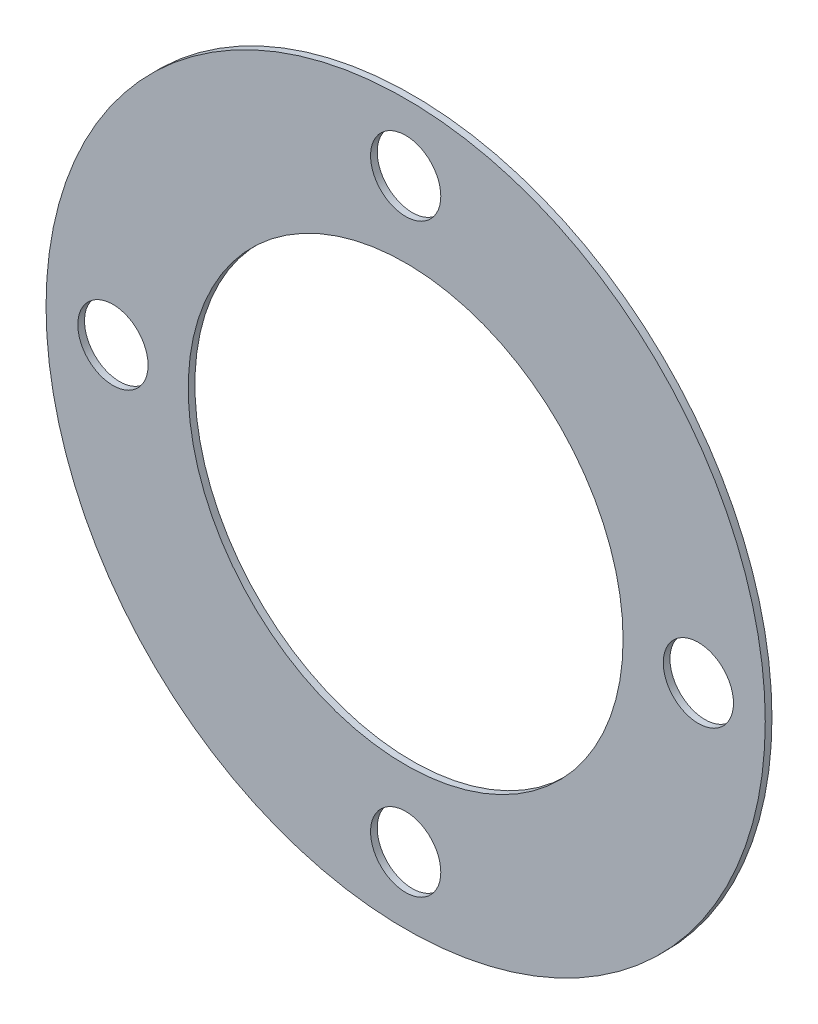
ISO-10303-21;
HEADER;
FILE_DESCRIPTION(('STEP AP214'),'2;1');
FILE_NAME('part.step','',(''),(''),'','','');
FILE_SCHEMA(('AUTOMOTIVE_DESIGN { 1 0 10303 214 1 1 1 1 }'));
ENDSEC;
DATA;
#1=APPLICATION_CONTEXT('core data for automotive mechanical design processes');
#2=APPLICATION_PROTOCOL_DEFINITION('international standard','automotive_design',2000,#1);
#3=PRODUCT_CONTEXT('',#1,'mechanical');
#4=PRODUCT('Part','Part','',(#3));
#5=PRODUCT_RELATED_PRODUCT_CATEGORY('part','',(#4));
#6=PRODUCT_DEFINITION_FORMATION('','',#4);
#7=PRODUCT_DEFINITION_CONTEXT('part definition',#1,'design');
#8=PRODUCT_DEFINITION('design','',#6,#7);
#9=PRODUCT_DEFINITION_SHAPE('','',#8);
#10=(LENGTH_UNIT() NAMED_UNIT(*) SI_UNIT(.MILLI.,.METRE.));
#11=(NAMED_UNIT(*) PLANE_ANGLE_UNIT() SI_UNIT($,.RADIAN.));
#12=(NAMED_UNIT(*) SI_UNIT($,.STERADIAN.) SOLID_ANGLE_UNIT());
#13=UNCERTAINTY_MEASURE_WITH_UNIT(LENGTH_MEASURE(1.E-05),#10,'distance_accuracy_value','');
#14=(GEOMETRIC_REPRESENTATION_CONTEXT(3) GLOBAL_UNCERTAINTY_ASSIGNED_CONTEXT((#13)) GLOBAL_UNIT_ASSIGNED_CONTEXT((#10,
#11,#12)) REPRESENTATION_CONTEXT('',''));
#15=CARTESIAN_POINT('',(0.,0.,0.));
#16=DIRECTION('',(0.,0.,1.));
#17=DIRECTION('',(1.,0.,0.));
#18=AXIS2_PLACEMENT_3D('',#15,#16,#17);
#19=CARTESIAN_POINT('',(0.,0.,0.4));
#20=DIRECTION('',(0.,0.,-1.));
#21=DIRECTION('',(-1.,0.,0.));
#22=AXIS2_PLACEMENT_3D('',#19,#20,#21);
#23=CYLINDRICAL_SURFACE('',#22,13.);
#24=CARTESIAN_POINT('',(0.,0.,0.4));
#25=DIRECTION('',(0.,0.,1.));
#26=DIRECTION('',(1.,0.,0.));
#27=AXIS2_PLACEMENT_3D('',#24,#25,#26);
#28=CIRCLE('',#27,13.);
#29=CARTESIAN_POINT('',(13.,0.,0.4));
#30=VERTEX_POINT('',#29);
#31=EDGE_CURVE('E49',#30,#30,#28,.T.);
#32=ORIENTED_EDGE('',*,*,#31,.T.);
#33=EDGE_LOOP('',(#32));
#34=FACE_BOUND('',#33,.T.);
#35=CARTESIAN_POINT('',(0.,0.,0.));
#36=DIRECTION('',(0.,0.,1.));
#37=DIRECTION('',(1.,0.,0.));
#38=AXIS2_PLACEMENT_3D('',#35,#36,#37);
#39=CIRCLE('',#38,13.);
#40=CARTESIAN_POINT('',(13.,0.,0.));
#41=VERTEX_POINT('',#40);
#42=EDGE_CURVE('E69',#41,#41,#39,.T.);
#43=ORIENTED_EDGE('',*,*,#42,.F.);
#44=EDGE_LOOP('',(#43));
#45=FACE_BOUND('',#44,.T.);
#46=ADVANCED_FACE('F41',(#34,#45),#23,.F.);
#47=CARTESIAN_POINT('',(0.,17.5,0.4));
#48=DIRECTION('',(0.,0.,-1.));
#49=DIRECTION('',(-1.,0.,0.));
#50=AXIS2_PLACEMENT_3D('',#47,#48,#49);
#51=CYLINDRICAL_SURFACE('',#50,2.1);
#52=CARTESIAN_POINT('',(0.,17.5,0.4));
#53=DIRECTION('',(0.,0.,1.));
#54=DIRECTION('',(1.,0.,0.));
#55=AXIS2_PLACEMENT_3D('',#52,#53,#54);
#56=CIRCLE('',#55,2.1);
#57=CARTESIAN_POINT('',(2.1,17.5,0.4));
#58=VERTEX_POINT('',#57);
#59=EDGE_CURVE('E54',#58,#58,#56,.T.);
#60=ORIENTED_EDGE('',*,*,#59,.T.);
#61=EDGE_LOOP('',(#60));
#62=FACE_BOUND('',#61,.T.);
#63=CARTESIAN_POINT('',(0.,17.5,0.));
#64=DIRECTION('',(0.,0.,1.));
#65=DIRECTION('',(1.,0.,0.));
#66=AXIS2_PLACEMENT_3D('',#63,#64,#65);
#67=CIRCLE('',#66,2.1);
#68=CARTESIAN_POINT('',(2.1,17.5,0.));
#69=VERTEX_POINT('',#68);
#70=EDGE_CURVE('E67',#69,#69,#67,.T.);
#71=ORIENTED_EDGE('',*,*,#70,.F.);
#72=EDGE_LOOP('',(#71));
#73=FACE_BOUND('',#72,.T.);
#74=ADVANCED_FACE('F90',(#62,#73),#51,.F.);
#75=CARTESIAN_POINT('',(17.5,0.,0.4));
#76=DIRECTION('',(0.,0.,-1.));
#77=DIRECTION('',(-1.,0.,0.));
#78=AXIS2_PLACEMENT_3D('',#75,#76,#77);
#79=CYLINDRICAL_SURFACE('',#78,2.1);
#80=CARTESIAN_POINT('',(17.5,0.,0.4));
#81=DIRECTION('',(0.,0.,1.));
#82=DIRECTION('',(1.,0.,0.));
#83=AXIS2_PLACEMENT_3D('',#80,#81,#82);
#84=CIRCLE('',#83,2.1);
#85=CARTESIAN_POINT('',(19.6,0.,0.4));
#86=VERTEX_POINT('',#85);
#87=EDGE_CURVE('E83',#86,#86,#84,.T.);
#88=ORIENTED_EDGE('',*,*,#87,.T.);
#89=EDGE_LOOP('',(#88));
#90=FACE_BOUND('',#89,.T.);
#91=CARTESIAN_POINT('',(17.5,0.,0.));
#92=DIRECTION('',(0.,0.,1.));
#93=DIRECTION('',(1.,0.,0.));
#94=AXIS2_PLACEMENT_3D('',#91,#92,#93);
#95=CIRCLE('',#94,2.1);
#96=CARTESIAN_POINT('',(19.6,0.,0.));
#97=VERTEX_POINT('',#96);
#98=EDGE_CURVE('E64',#97,#97,#95,.T.);
#99=ORIENTED_EDGE('',*,*,#98,.F.);
#100=EDGE_LOOP('',(#99));
#101=FACE_BOUND('',#100,.T.);
#102=ADVANCED_FACE('F108',(#90,#101),#79,.F.);
#103=CARTESIAN_POINT('',(-1.2220184685951E-13,-17.5,0.4));
#104=DIRECTION('',(0.,0.,-1.));
#105=DIRECTION('',(-1.,0.,0.));
#106=AXIS2_PLACEMENT_3D('',#103,#104,#105);
#107=CYLINDRICAL_SURFACE('',#106,2.1);
#108=CARTESIAN_POINT('',(-1.2220184685951E-13,-17.5,0.4));
#109=DIRECTION('',(0.,0.,1.));
#110=DIRECTION('',(1.,0.,0.));
#111=AXIS2_PLACEMENT_3D('',#108,#109,#110);
#112=CIRCLE('',#111,2.1);
#113=CARTESIAN_POINT('',(2.09999999999988,-17.5,0.4));
#114=VERTEX_POINT('',#113);
#115=EDGE_CURVE('E78',#114,#114,#112,.T.);
#116=ORIENTED_EDGE('',*,*,#115,.T.);
#117=EDGE_LOOP('',(#116));
#118=FACE_BOUND('',#117,.T.);
#119=CARTESIAN_POINT('',(-1.2220184685951E-13,-17.5,0.));
#120=DIRECTION('',(0.,0.,1.));
#121=DIRECTION('',(1.,0.,0.));
#122=AXIS2_PLACEMENT_3D('',#119,#120,#121);
#123=CIRCLE('',#122,2.1);
#124=CARTESIAN_POINT('',(2.09999999999988,-17.5,0.));
#125=VERTEX_POINT('',#124);
#126=EDGE_CURVE('E61',#125,#125,#123,.T.);
#127=ORIENTED_EDGE('',*,*,#126,.F.);
#128=EDGE_LOOP('',(#127));
#129=FACE_BOUND('',#128,.T.);
#130=ADVANCED_FACE('F114',(#118,#129),#107,.F.);
#131=CARTESIAN_POINT('',(-17.5,1.83302770289265E-13,0.4));
#132=DIRECTION('',(0.,0.,-1.));
#133=DIRECTION('',(-1.,0.,0.));
#134=AXIS2_PLACEMENT_3D('',#131,#132,#133);
#135=CYLINDRICAL_SURFACE('',#134,2.1);
#136=CARTESIAN_POINT('',(-17.5,1.83302770289265E-13,0.4));
#137=DIRECTION('',(0.,0.,1.));
#138=DIRECTION('',(1.,0.,0.));
#139=AXIS2_PLACEMENT_3D('',#136,#137,#138);
#140=CIRCLE('',#139,2.1);
#141=CARTESIAN_POINT('',(-15.4,1.83302770289265E-13,0.4));
#142=VERTEX_POINT('',#141);
#143=EDGE_CURVE('E74',#142,#142,#140,.T.);
#144=ORIENTED_EDGE('',*,*,#143,.T.);
#145=EDGE_LOOP('',(#144));
#146=FACE_BOUND('',#145,.T.);
#147=CARTESIAN_POINT('',(-17.5,1.83302770289265E-13,0.));
#148=DIRECTION('',(0.,0.,1.));
#149=DIRECTION('',(1.,0.,0.));
#150=AXIS2_PLACEMENT_3D('',#147,#148,#149);
#151=CIRCLE('',#150,2.1);
#152=CARTESIAN_POINT('',(-15.4,1.83302770289265E-13,0.));
#153=VERTEX_POINT('',#152);
#154=EDGE_CURVE('E58',#153,#153,#151,.T.);
#155=ORIENTED_EDGE('',*,*,#154,.F.);
#156=EDGE_LOOP('',(#155));
#157=FACE_BOUND('',#156,.T.);
#158=ADVANCED_FACE('F43',(#146,#157),#135,.F.);
#159=CARTESIAN_POINT('',(0.,0.,0.4));
#160=DIRECTION('',(0.,0.,-1.));
#161=DIRECTION('',(-1.,0.,0.));
#162=AXIS2_PLACEMENT_3D('',#159,#160,#161);
#163=CYLINDRICAL_SURFACE('',#162,21.5);
#164=CARTESIAN_POINT('',(0.,0.,0.));
#165=DIRECTION('',(0.,0.,1.));
#166=DIRECTION('',(1.,0.,0.));
#167=AXIS2_PLACEMENT_3D('',#164,#165,#166);
#168=CIRCLE('',#167,21.5);
#169=CARTESIAN_POINT('',(21.5,0.,0.));
#170=VERTEX_POINT('',#169);
#171=EDGE_CURVE('E45',#170,#170,#168,.T.);
#172=ORIENTED_EDGE('',*,*,#171,.T.);
#173=EDGE_LOOP('',(#172));
#174=FACE_BOUND('',#173,.T.);
#175=CARTESIAN_POINT('',(0.,0.,0.4));
#176=DIRECTION('',(0.,0.,1.));
#177=DIRECTION('',(1.,0.,0.));
#178=AXIS2_PLACEMENT_3D('',#175,#176,#177);
#179=CIRCLE('',#178,21.5);
#180=CARTESIAN_POINT('',(21.5,0.,0.4));
#181=VERTEX_POINT('',#180);
#182=EDGE_CURVE('E10',#181,#181,#179,.T.);
#183=ORIENTED_EDGE('',*,*,#182,.F.);
#184=EDGE_LOOP('',(#183));
#185=FACE_BOUND('',#184,.T.);
#186=ADVANCED_FACE('F97',(#174,#185),#163,.T.);
#187=CARTESIAN_POINT('',(0.,0.,0.4));
#188=DIRECTION('',(0.,0.,1.));
#189=DIRECTION('',(1.,0.,0.));
#190=AXIS2_PLACEMENT_3D('',#187,#188,#189);
#191=PLANE('',#190);
#192=ORIENTED_EDGE('',*,*,#143,.F.);
#193=EDGE_LOOP('',(#192));
#194=FACE_BOUND('',#193,.T.);
#195=ORIENTED_EDGE('',*,*,#115,.F.);
#196=EDGE_LOOP('',(#195));
#197=FACE_BOUND('',#196,.T.);
#198=ORIENTED_EDGE('',*,*,#87,.F.);
#199=EDGE_LOOP('',(#198));
#200=FACE_BOUND('',#199,.T.);
#201=ORIENTED_EDGE('',*,*,#59,.F.);
#202=EDGE_LOOP('',(#201));
#203=FACE_BOUND('',#202,.T.);
#204=ORIENTED_EDGE('',*,*,#31,.F.);
#205=EDGE_LOOP('',(#204));
#206=FACE_BOUND('',#205,.T.);
#207=ORIENTED_EDGE('',*,*,#182,.T.);
#208=EDGE_LOOP('',(#207));
#209=FACE_BOUND('',#208,.T.);
#210=ADVANCED_FACE('F93',(#194,#197,#200,#203,#206,#209),#191,.T.);
#211=CARTESIAN_POINT('',(0.,0.,0.));
#212=DIRECTION('',(0.,0.,1.));
#213=DIRECTION('',(1.,0.,0.));
#214=AXIS2_PLACEMENT_3D('',#211,#212,#213);
#215=PLANE('',#214);
#216=ORIENTED_EDGE('',*,*,#154,.T.);
#217=EDGE_LOOP('',(#216));
#218=FACE_BOUND('',#217,.T.);
#219=ORIENTED_EDGE('',*,*,#126,.T.);
#220=EDGE_LOOP('',(#219));
#221=FACE_BOUND('',#220,.T.);
#222=ORIENTED_EDGE('',*,*,#98,.T.);
#223=EDGE_LOOP('',(#222));
#224=FACE_BOUND('',#223,.T.);
#225=ORIENTED_EDGE('',*,*,#70,.T.);
#226=EDGE_LOOP('',(#225));
#227=FACE_BOUND('',#226,.T.);
#228=ORIENTED_EDGE('',*,*,#42,.T.);
#229=EDGE_LOOP('',(#228));
#230=FACE_BOUND('',#229,.T.);
#231=ORIENTED_EDGE('',*,*,#171,.F.);
#232=EDGE_LOOP('',(#231));
#233=FACE_BOUND('',#232,.T.);
#234=ADVANCED_FACE('F96',(#218,#221,#224,#227,#230,#233),#215,.F.);
#235=CLOSED_SHELL('',(#46,#74,#102,#130,#158,#186,#210,#234));
#236=MANIFOLD_SOLID_BREP('B2',#235);
#237=ADVANCED_BREP_SHAPE_REPRESENTATION('',(#18,#236),#14);
#238=SHAPE_DEFINITION_REPRESENTATION(#9,#237);
ENDSEC;
END-ISO-10303-21;
